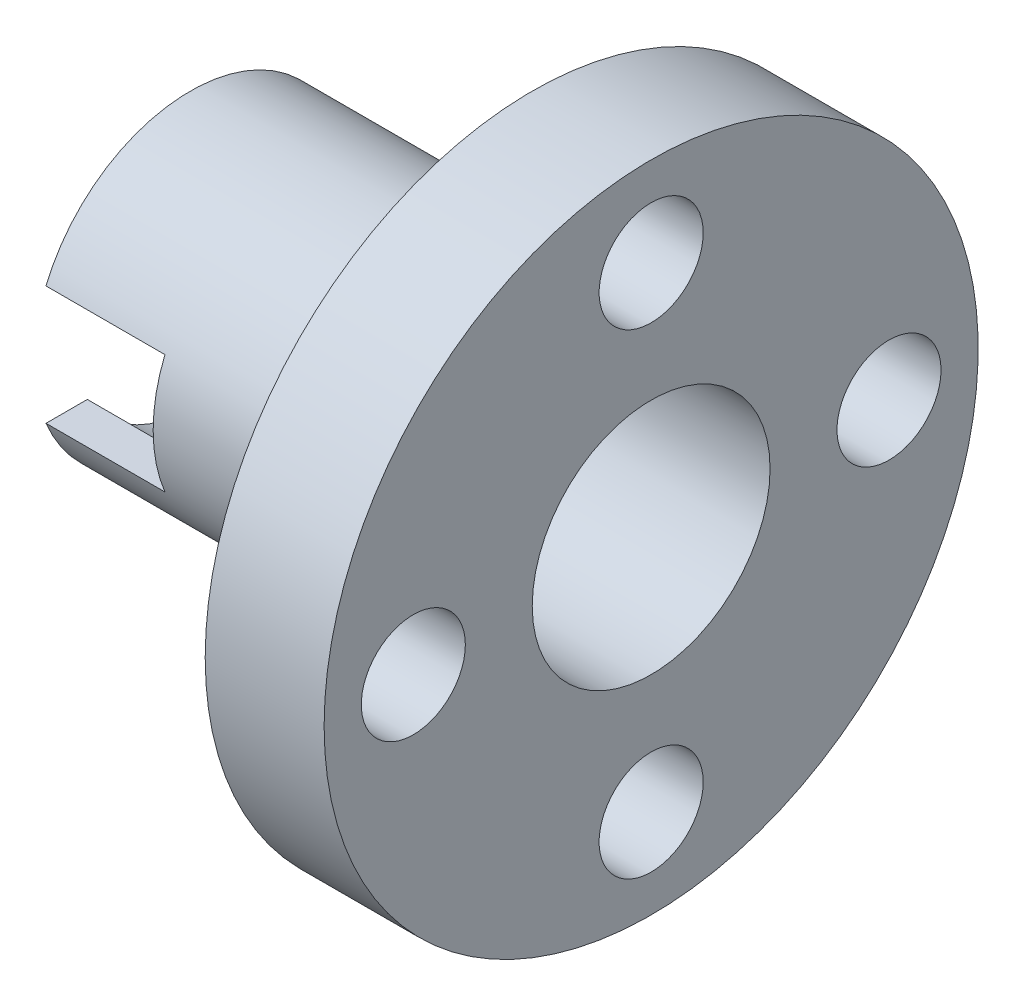
ISO-10303-21;
HEADER;
FILE_DESCRIPTION(('STEP AP214'),'2;1');
FILE_NAME('part.step','',(''),(''),'','','');
FILE_SCHEMA(('AUTOMOTIVE_DESIGN { 1 0 10303 214 1 1 1 1 }'));
ENDSEC;
DATA;
#1=APPLICATION_CONTEXT('core data for automotive mechanical design processes');
#2=APPLICATION_PROTOCOL_DEFINITION('international standard','automotive_design',2000,#1);
#3=PRODUCT_CONTEXT('',#1,'mechanical');
#4=PRODUCT('Part','Part','',(#3));
#5=PRODUCT_RELATED_PRODUCT_CATEGORY('part','',(#4));
#6=PRODUCT_DEFINITION_FORMATION('','',#4);
#7=PRODUCT_DEFINITION_CONTEXT('part definition',#1,'design');
#8=PRODUCT_DEFINITION('design','',#6,#7);
#9=PRODUCT_DEFINITION_SHAPE('','',#8);
#10=(LENGTH_UNIT() NAMED_UNIT(*) SI_UNIT(.MILLI.,.METRE.));
#11=(NAMED_UNIT(*) PLANE_ANGLE_UNIT() SI_UNIT($,.RADIAN.));
#12=(NAMED_UNIT(*) SI_UNIT($,.STERADIAN.) SOLID_ANGLE_UNIT());
#13=UNCERTAINTY_MEASURE_WITH_UNIT(LENGTH_MEASURE(1.E-05),#10,'distance_accuracy_value','');
#14=(GEOMETRIC_REPRESENTATION_CONTEXT(3) GLOBAL_UNCERTAINTY_ASSIGNED_CONTEXT((#13)) GLOBAL_UNIT_ASSIGNED_CONTEXT((#10,
#11,#12)) REPRESENTATION_CONTEXT('',''));
#15=CARTESIAN_POINT('',(0.,0.,0.));
#16=DIRECTION('',(0.,0.,1.));
#17=DIRECTION('',(1.,0.,0.));
#18=AXIS2_PLACEMENT_3D('',#15,#16,#17);
#19=CARTESIAN_POINT('',(-15.5,0.,-4.));
#20=DIRECTION('',(1.,0.,0.));
#21=DIRECTION('',(0.,0.,-1.));
#22=AXIS2_PLACEMENT_3D('',#19,#20,#21);
#23=PLANE('',#22);
#24=CARTESIAN_POINT('',(-15.5,0.,0.));
#25=DIRECTION('',(-1.,0.,0.));
#26=DIRECTION('',(0.,0.,1.));
#27=AXIS2_PLACEMENT_3D('',#24,#25,#26);
#28=CIRCLE('',#27,5.25);
#29=CARTESIAN_POINT('',(-15.5,2.,4.8541219597369));
#30=VERTEX_POINT('',#29);
#31=CARTESIAN_POINT('',(-15.5,2.,-4.8541219597369));
#32=VERTEX_POINT('',#31);
#33=EDGE_CURVE('E178',#30,#32,#28,.T.);
#34=ORIENTED_EDGE('',*,*,#33,.T.);
#35=DIRECTION('',(0.,0.,1.));
#36=VECTOR('',#35,1.);
#37=CARTESIAN_POINT('',(-15.5,2.,-11.));
#38=LINE('',#37,#36);
#39=CARTESIAN_POINT('',(-15.5,2.,-3.46410161513775));
#40=VERTEX_POINT('',#39);
#41=EDGE_CURVE('E124',#32,#40,#38,.T.);
#42=ORIENTED_EDGE('',*,*,#41,.T.);
#43=CARTESIAN_POINT('',(-15.5,0.,0.));
#44=DIRECTION('',(-1.,0.,0.));
#45=DIRECTION('',(0.,0.,1.));
#46=AXIS2_PLACEMENT_3D('',#43,#44,#45);
#47=CIRCLE('',#46,4.);
#48=CARTESIAN_POINT('',(-15.5,2.,3.46410161513775));
#49=VERTEX_POINT('',#48);
#50=EDGE_CURVE('E175',#49,#40,#47,.T.);
#51=ORIENTED_EDGE('',*,*,#50,.F.);
#52=EDGE_CURVE('E128',#49,#30,#38,.T.);
#53=ORIENTED_EDGE('',*,*,#52,.T.);
#54=EDGE_LOOP('',(#34,#42,#51,#53));
#55=FACE_BOUND('',#54,.T.);
#56=ADVANCED_FACE('F34',(#55),#23,.F.);
#57=CARTESIAN_POINT('',(-43.7073170731707,0.,0.));
#58=DIRECTION('',(-1.,0.,0.));
#59=DIRECTION('',(0.,0.,1.));
#60=AXIS2_PLACEMENT_3D('',#57,#58,#59);
#61=CYLINDRICAL_SURFACE('',#60,5.25);
#62=ORIENTED_EDGE('',*,*,#33,.F.);
#63=DIRECTION('',(-1.,0.,0.));
#64=VECTOR('',#63,1.);
#65=CARTESIAN_POINT('',(-43.7073170731707,2.,4.8541219597369));
#66=LINE('',#65,#64);
#67=CARTESIAN_POINT('',(-11.5,2.,4.8541219597369));
#68=VERTEX_POINT('',#67);
#69=EDGE_CURVE('E133',#30,#68,#66,.F.);
#70=ORIENTED_EDGE('',*,*,#69,.T.);
#71=CARTESIAN_POINT('',(-11.5,0.,0.));
#72=DIRECTION('',(1.,0.,0.));
#73=DIRECTION('',(0.,0.,-1.));
#74=AXIS2_PLACEMENT_3D('',#71,#72,#73);
#75=CIRCLE('',#74,5.25);
#76=CARTESIAN_POINT('',(-11.5,-2.,4.8541219597369));
#77=VERTEX_POINT('',#76);
#78=EDGE_CURVE('E110',#68,#77,#75,.T.);
#79=ORIENTED_EDGE('',*,*,#78,.T.);
#80=DIRECTION('',(-1.,0.,0.));
#81=VECTOR('',#80,1.);
#82=CARTESIAN_POINT('',(-43.7073170731707,-2.,4.8541219597369));
#83=LINE('',#82,#81);
#84=CARTESIAN_POINT('',(-15.5,-2.,4.8541219597369));
#85=VERTEX_POINT('',#84);
#86=EDGE_CURVE('E111',#77,#85,#83,.T.);
#87=ORIENTED_EDGE('',*,*,#86,.T.);
#88=CARTESIAN_POINT('',(-15.5,-2.,-4.8541219597369));
#89=VERTEX_POINT('',#88);
#90=EDGE_CURVE('E123',#89,#85,#28,.T.);
#91=ORIENTED_EDGE('',*,*,#90,.F.);
#92=DIRECTION('',(-1.,0.,0.));
#93=VECTOR('',#92,1.);
#94=CARTESIAN_POINT('',(-43.7073170731707,-2.,-4.8541219597369));
#95=LINE('',#94,#93);
#96=CARTESIAN_POINT('',(-11.5,-2.,-4.8541219597369));
#97=VERTEX_POINT('',#96);
#98=EDGE_CURVE('E114',#89,#97,#95,.F.);
#99=ORIENTED_EDGE('',*,*,#98,.T.);
#100=CARTESIAN_POINT('',(-11.5,2.,-4.8541219597369));
#101=VERTEX_POINT('',#100);
#102=EDGE_CURVE('E100',#97,#101,#75,.T.);
#103=ORIENTED_EDGE('',*,*,#102,.T.);
#104=DIRECTION('',(-1.,0.,0.));
#105=VECTOR('',#104,1.);
#106=CARTESIAN_POINT('',(-43.7073170731707,2.,-4.8541219597369));
#107=LINE('',#106,#105);
#108=EDGE_CURVE('E136',#101,#32,#107,.T.);
#109=ORIENTED_EDGE('',*,*,#108,.T.);
#110=EDGE_LOOP('',(#62,#70,#79,#87,#91,#99,#103,#109));
#111=FACE_BOUND('',#110,.T.);
#112=CARTESIAN_POINT('',(-4.,0.,0.));
#113=DIRECTION('',(-1.,0.,0.));
#114=DIRECTION('',(0.,0.,1.));
#115=AXIS2_PLACEMENT_3D('',#112,#113,#114);
#116=CIRCLE('',#115,5.25);
#117=CARTESIAN_POINT('',(-4.,0.,5.25));
#118=VERTEX_POINT('',#117);
#119=EDGE_CURVE('E146',#118,#118,#116,.T.);
#120=ORIENTED_EDGE('',*,*,#119,.T.);
#121=EDGE_LOOP('',(#120));
#122=FACE_BOUND('',#121,.T.);
#123=ADVANCED_FACE('F36',(#111,#122),#61,.T.);
#124=ORIENTED_EDGE('',*,*,#90,.T.);
#125=DIRECTION('',(0.,0.,1.));
#126=VECTOR('',#125,1.);
#127=CARTESIAN_POINT('',(-15.5,-2.,-11.));
#128=LINE('',#127,#126);
#129=CARTESIAN_POINT('',(-15.5,-2.,3.46410161513775));
#130=VERTEX_POINT('',#129);
#131=EDGE_CURVE('E131',#130,#85,#128,.T.);
#132=ORIENTED_EDGE('',*,*,#131,.F.);
#133=CARTESIAN_POINT('',(-15.5,-2.,-3.46410161513775));
#134=VERTEX_POINT('',#133);
#135=EDGE_CURVE('E174',#134,#130,#47,.T.);
#136=ORIENTED_EDGE('',*,*,#135,.F.);
#137=EDGE_CURVE('E57',#89,#134,#128,.T.);
#138=ORIENTED_EDGE('',*,*,#137,.F.);
#139=EDGE_LOOP('',(#124,#132,#136,#138));
#140=FACE_BOUND('',#139,.T.);
#141=ADVANCED_FACE('F204',(#140),#23,.F.);
#142=CARTESIAN_POINT('',(-43.7073170731707,0.,0.));
#143=DIRECTION('',(-1.,0.,0.));
#144=DIRECTION('',(0.,0.,1.));
#145=AXIS2_PLACEMENT_3D('',#142,#143,#144);
#146=CYLINDRICAL_SURFACE('',#145,4.);
#147=CARTESIAN_POINT('',(0.,0.,0.));
#148=DIRECTION('',(-1.,0.,0.));
#149=DIRECTION('',(0.,0.,1.));
#150=AXIS2_PLACEMENT_3D('',#147,#148,#149);
#151=CIRCLE('',#150,4.);
#152=CARTESIAN_POINT('',(0.,0.,4.));
#153=VERTEX_POINT('',#152);
#154=EDGE_CURVE('E171',#153,#153,#151,.T.);
#155=ORIENTED_EDGE('',*,*,#154,.F.);
#156=EDGE_LOOP('',(#155));
#157=FACE_BOUND('',#156,.T.);
#158=CARTESIAN_POINT('',(-11.5,0.,0.));
#159=DIRECTION('',(1.,0.,0.));
#160=DIRECTION('',(0.,0.,-1.));
#161=AXIS2_PLACEMENT_3D('',#158,#159,#160);
#162=CIRCLE('',#161,4.);
#163=CARTESIAN_POINT('',(-11.5,-2.,3.46410161513775));
#164=VERTEX_POINT('',#163);
#165=CARTESIAN_POINT('',(-11.5,2.,3.46410161513775));
#166=VERTEX_POINT('',#165);
#167=EDGE_CURVE('E42',#164,#166,#162,.F.);
#168=ORIENTED_EDGE('',*,*,#167,.T.);
#169=DIRECTION('',(-1.,0.,0.));
#170=VECTOR('',#169,1.);
#171=CARTESIAN_POINT('',(-43.7073170731707,2.,3.46410161513775));
#172=LINE('',#171,#170);
#173=EDGE_CURVE('E11',#166,#49,#172,.T.);
#174=ORIENTED_EDGE('',*,*,#173,.T.);
#175=ORIENTED_EDGE('',*,*,#50,.T.);
#176=DIRECTION('',(-1.,0.,0.));
#177=VECTOR('',#176,1.);
#178=CARTESIAN_POINT('',(-43.7073170731707,2.,-3.46410161513775));
#179=LINE('',#178,#177);
#180=CARTESIAN_POINT('',(-11.5,2.,-3.46410161513775));
#181=VERTEX_POINT('',#180);
#182=EDGE_CURVE('E184',#40,#181,#179,.F.);
#183=ORIENTED_EDGE('',*,*,#182,.T.);
#184=CARTESIAN_POINT('',(-11.5,-2.,-3.46410161513775));
#185=VERTEX_POINT('',#184);
#186=EDGE_CURVE('E182',#181,#185,#162,.F.);
#187=ORIENTED_EDGE('',*,*,#186,.T.);
#188=DIRECTION('',(-1.,0.,0.));
#189=VECTOR('',#188,1.);
#190=CARTESIAN_POINT('',(-43.7073170731707,-2.,-3.46410161513775));
#191=LINE('',#190,#189);
#192=EDGE_CURVE('E115',#185,#134,#191,.T.);
#193=ORIENTED_EDGE('',*,*,#192,.T.);
#194=ORIENTED_EDGE('',*,*,#135,.T.);
#195=DIRECTION('',(-1.,0.,0.));
#196=VECTOR('',#195,1.);
#197=CARTESIAN_POINT('',(-43.7073170731707,-2.,3.46410161513775));
#198=LINE('',#197,#196);
#199=EDGE_CURVE('E186',#130,#164,#198,.F.);
#200=ORIENTED_EDGE('',*,*,#199,.T.);
#201=EDGE_LOOP('',(#168,#174,#175,#183,#187,#193,#194,#200));
#202=FACE_BOUND('',#201,.T.);
#203=ADVANCED_FACE('F191',(#157,#202),#146,.F.);
#204=CARTESIAN_POINT('',(0.,0.,-11.));
#205=DIRECTION('',(-1.,0.,0.));
#206=DIRECTION('',(0.,0.,1.));
#207=AXIS2_PLACEMENT_3D('',#204,#205,#206);
#208=PLANE('',#207);
#209=CARTESIAN_POINT('',(0.,8.,0.));
#210=DIRECTION('',(1.,0.,0.));
#211=DIRECTION('',(0.,0.,-1.));
#212=AXIS2_PLACEMENT_3D('',#209,#210,#211);
#213=CIRCLE('',#212,1.75);
#214=CARTESIAN_POINT('',(0.,8.,-1.75));
#215=VERTEX_POINT('',#214);
#216=EDGE_CURVE('E139',#215,#215,#213,.T.);
#217=ORIENTED_EDGE('',*,*,#216,.F.);
#218=EDGE_LOOP('',(#217));
#219=FACE_BOUND('',#218,.T.);
#220=CARTESIAN_POINT('',(0.,0.,-8.));
#221=DIRECTION('',(1.,0.,0.));
#222=DIRECTION('',(0.,0.,-1.));
#223=AXIS2_PLACEMENT_3D('',#220,#221,#222);
#224=CIRCLE('',#223,1.75);
#225=CARTESIAN_POINT('',(0.,0.,-9.75));
#226=VERTEX_POINT('',#225);
#227=EDGE_CURVE('E147',#226,#226,#224,.T.);
#228=ORIENTED_EDGE('',*,*,#227,.F.);
#229=EDGE_LOOP('',(#228));
#230=FACE_BOUND('',#229,.T.);
#231=CARTESIAN_POINT('',(0.,-8.,0.));
#232=DIRECTION('',(1.,0.,0.));
#233=DIRECTION('',(0.,0.,-1.));
#234=AXIS2_PLACEMENT_3D('',#231,#232,#233);
#235=CIRCLE('',#234,1.75);
#236=CARTESIAN_POINT('',(0.,-8.,-1.75));
#237=VERTEX_POINT('',#236);
#238=EDGE_CURVE('E153',#237,#237,#235,.T.);
#239=ORIENTED_EDGE('',*,*,#238,.F.);
#240=EDGE_LOOP('',(#239));
#241=FACE_BOUND('',#240,.T.);
#242=CARTESIAN_POINT('',(0.,0.,8.));
#243=DIRECTION('',(1.,0.,0.));
#244=DIRECTION('',(0.,0.,-1.));
#245=AXIS2_PLACEMENT_3D('',#242,#243,#244);
#246=CIRCLE('',#245,1.75);
#247=CARTESIAN_POINT('',(0.,0.,6.25));
#248=VERTEX_POINT('',#247);
#249=EDGE_CURVE('E138',#248,#248,#246,.T.);
#250=ORIENTED_EDGE('',*,*,#249,.F.);
#251=EDGE_LOOP('',(#250));
#252=FACE_BOUND('',#251,.T.);
#253=CARTESIAN_POINT('',(0.,0.,0.));
#254=DIRECTION('',(-1.,0.,0.));
#255=DIRECTION('',(0.,0.,1.));
#256=AXIS2_PLACEMENT_3D('',#253,#254,#255);
#257=CIRCLE('',#256,11.);
#258=CARTESIAN_POINT('',(0.,0.,11.));
#259=VERTEX_POINT('',#258);
#260=EDGE_CURVE('E168',#259,#259,#257,.T.);
#261=ORIENTED_EDGE('',*,*,#260,.F.);
#262=EDGE_LOOP('',(#261));
#263=FACE_BOUND('',#262,.T.);
#264=ORIENTED_EDGE('',*,*,#154,.T.);
#265=EDGE_LOOP('',(#264));
#266=FACE_BOUND('',#265,.T.);
#267=ADVANCED_FACE('F226',(#219,#230,#241,#252,#263,#266),#208,.F.);
#268=CARTESIAN_POINT('',(-43.7073170731707,0.,0.));
#269=DIRECTION('',(-1.,0.,0.));
#270=DIRECTION('',(0.,0.,1.));
#271=AXIS2_PLACEMENT_3D('',#268,#269,#270);
#272=CYLINDRICAL_SURFACE('',#271,11.);
#273=CARTESIAN_POINT('',(-4.,0.,0.));
#274=DIRECTION('',(-1.,0.,0.));
#275=DIRECTION('',(0.,0.,1.));
#276=AXIS2_PLACEMENT_3D('',#273,#274,#275);
#277=CIRCLE('',#276,11.);
#278=CARTESIAN_POINT('',(-4.,0.,11.));
#279=VERTEX_POINT('',#278);
#280=EDGE_CURVE('E165',#279,#279,#277,.T.);
#281=ORIENTED_EDGE('',*,*,#280,.F.);
#282=EDGE_LOOP('',(#281));
#283=FACE_BOUND('',#282,.T.);
#284=ORIENTED_EDGE('',*,*,#260,.T.);
#285=EDGE_LOOP('',(#284));
#286=FACE_BOUND('',#285,.T.);
#287=ADVANCED_FACE('F231',(#283,#286),#272,.T.);
#288=CARTESIAN_POINT('',(-4.,0.,-5.25));
#289=DIRECTION('',(1.,0.,0.));
#290=DIRECTION('',(0.,0.,-1.));
#291=AXIS2_PLACEMENT_3D('',#288,#289,#290);
#292=PLANE('',#291);
#293=CARTESIAN_POINT('',(-4.,8.,0.));
#294=DIRECTION('',(1.,0.,0.));
#295=DIRECTION('',(0.,0.,-1.));
#296=AXIS2_PLACEMENT_3D('',#293,#294,#295);
#297=CIRCLE('',#296,1.75);
#298=CARTESIAN_POINT('',(-4.,8.,-1.75));
#299=VERTEX_POINT('',#298);
#300=EDGE_CURVE('E142',#299,#299,#297,.F.);
#301=ORIENTED_EDGE('',*,*,#300,.F.);
#302=EDGE_LOOP('',(#301));
#303=FACE_BOUND('',#302,.T.);
#304=CARTESIAN_POINT('',(-4.,0.,-8.));
#305=DIRECTION('',(1.,0.,0.));
#306=DIRECTION('',(0.,0.,-1.));
#307=AXIS2_PLACEMENT_3D('',#304,#305,#306);
#308=CIRCLE('',#307,1.75);
#309=CARTESIAN_POINT('',(-4.,0.,-9.75));
#310=VERTEX_POINT('',#309);
#311=EDGE_CURVE('E143',#310,#310,#308,.F.);
#312=ORIENTED_EDGE('',*,*,#311,.F.);
#313=EDGE_LOOP('',(#312));
#314=FACE_BOUND('',#313,.T.);
#315=CARTESIAN_POINT('',(-4.,-8.,0.));
#316=DIRECTION('',(1.,0.,0.));
#317=DIRECTION('',(0.,0.,-1.));
#318=AXIS2_PLACEMENT_3D('',#315,#316,#317);
#319=CIRCLE('',#318,1.75);
#320=CARTESIAN_POINT('',(-4.,-8.,-1.75));
#321=VERTEX_POINT('',#320);
#322=EDGE_CURVE('E150',#321,#321,#319,.F.);
#323=ORIENTED_EDGE('',*,*,#322,.F.);
#324=EDGE_LOOP('',(#323));
#325=FACE_BOUND('',#324,.T.);
#326=CARTESIAN_POINT('',(-4.,0.,8.));
#327=DIRECTION('',(1.,0.,0.));
#328=DIRECTION('',(0.,0.,-1.));
#329=AXIS2_PLACEMENT_3D('',#326,#327,#328);
#330=CIRCLE('',#329,1.75);
#331=CARTESIAN_POINT('',(-4.,0.,6.25));
#332=VERTEX_POINT('',#331);
#333=EDGE_CURVE('E156',#332,#332,#330,.F.);
#334=ORIENTED_EDGE('',*,*,#333,.F.);
#335=EDGE_LOOP('',(#334));
#336=FACE_BOUND('',#335,.T.);
#337=ORIENTED_EDGE('',*,*,#119,.F.);
#338=EDGE_LOOP('',(#337));
#339=FACE_BOUND('',#338,.T.);
#340=ORIENTED_EDGE('',*,*,#280,.T.);
#341=EDGE_LOOP('',(#340));
#342=FACE_BOUND('',#341,.T.);
#343=ADVANCED_FACE('F238',(#303,#314,#325,#336,#339,#342),#292,.F.);
#344=CARTESIAN_POINT('',(-15.501,0.,8.));
#345=DIRECTION('',(1.,0.,0.));
#346=DIRECTION('',(0.,0.,-1.));
#347=AXIS2_PLACEMENT_3D('',#344,#345,#346);
#348=CYLINDRICAL_SURFACE('',#347,1.75);
#349=ORIENTED_EDGE('',*,*,#249,.T.);
#350=EDGE_LOOP('',(#349));
#351=FACE_BOUND('',#350,.T.);
#352=ORIENTED_EDGE('',*,*,#333,.T.);
#353=EDGE_LOOP('',(#352));
#354=FACE_BOUND('',#353,.T.);
#355=ADVANCED_FACE('F242',(#351,#354),#348,.F.);
#356=CARTESIAN_POINT('',(-15.501,-8.,0.));
#357=DIRECTION('',(1.,0.,0.));
#358=DIRECTION('',(0.,0.,-1.));
#359=AXIS2_PLACEMENT_3D('',#356,#357,#358);
#360=CYLINDRICAL_SURFACE('',#359,1.75);
#361=ORIENTED_EDGE('',*,*,#238,.T.);
#362=EDGE_LOOP('',(#361));
#363=FACE_BOUND('',#362,.T.);
#364=ORIENTED_EDGE('',*,*,#322,.T.);
#365=EDGE_LOOP('',(#364));
#366=FACE_BOUND('',#365,.T.);
#367=ADVANCED_FACE('F246',(#363,#366),#360,.F.);
#368=CARTESIAN_POINT('',(-15.501,0.,-8.));
#369=DIRECTION('',(1.,0.,0.));
#370=DIRECTION('',(0.,0.,-1.));
#371=AXIS2_PLACEMENT_3D('',#368,#369,#370);
#372=CYLINDRICAL_SURFACE('',#371,1.75);
#373=ORIENTED_EDGE('',*,*,#227,.T.);
#374=EDGE_LOOP('',(#373));
#375=FACE_BOUND('',#374,.T.);
#376=ORIENTED_EDGE('',*,*,#311,.T.);
#377=EDGE_LOOP('',(#376));
#378=FACE_BOUND('',#377,.T.);
#379=ADVANCED_FACE('F250',(#375,#378),#372,.F.);
#380=CARTESIAN_POINT('',(-15.501,8.,0.));
#381=DIRECTION('',(1.,0.,0.));
#382=DIRECTION('',(0.,0.,-1.));
#383=AXIS2_PLACEMENT_3D('',#380,#381,#382);
#384=CYLINDRICAL_SURFACE('',#383,1.75);
#385=ORIENTED_EDGE('',*,*,#216,.T.);
#386=EDGE_LOOP('',(#385));
#387=FACE_BOUND('',#386,.T.);
#388=ORIENTED_EDGE('',*,*,#300,.T.);
#389=EDGE_LOOP('',(#388));
#390=FACE_BOUND('',#389,.T.);
#391=ADVANCED_FACE('F254',(#387,#390),#384,.F.);
#392=CARTESIAN_POINT('',(-15.5,-2.,-11.));
#393=DIRECTION('',(0.,-1.,0.));
#394=DIRECTION('',(0.,0.,-1.));
#395=AXIS2_PLACEMENT_3D('',#392,#393,#394);
#396=PLANE('',#395);
#397=ORIENTED_EDGE('',*,*,#137,.T.);
#398=ORIENTED_EDGE('',*,*,#192,.F.);
#399=DIRECTION('',(0.,0.,1.));
#400=VECTOR('',#399,1.);
#401=CARTESIAN_POINT('',(-11.5,-2.,-11.));
#402=LINE('',#401,#400);
#403=EDGE_CURVE('E103',#97,#185,#402,.T.);
#404=ORIENTED_EDGE('',*,*,#403,.F.);
#405=ORIENTED_EDGE('',*,*,#98,.F.);
#406=EDGE_LOOP('',(#397,#398,#404,#405));
#407=FACE_BOUND('',#406,.T.);
#408=ADVANCED_FACE('F113',(#407),#396,.F.);
#409=CARTESIAN_POINT('',(-11.5,2.,-11.));
#410=DIRECTION('',(1.,0.,0.));
#411=DIRECTION('',(0.,0.,-1.));
#412=AXIS2_PLACEMENT_3D('',#409,#410,#411);
#413=PLANE('',#412);
#414=ORIENTED_EDGE('',*,*,#403,.T.);
#415=ORIENTED_EDGE('',*,*,#186,.F.);
#416=DIRECTION('',(0.,0.,1.));
#417=VECTOR('',#416,1.);
#418=CARTESIAN_POINT('',(-11.5,2.,-11.));
#419=LINE('',#418,#417);
#420=EDGE_CURVE('E106',#101,#181,#419,.T.);
#421=ORIENTED_EDGE('',*,*,#420,.F.);
#422=ORIENTED_EDGE('',*,*,#102,.F.);
#423=EDGE_LOOP('',(#414,#415,#421,#422));
#424=FACE_BOUND('',#423,.T.);
#425=ADVANCED_FACE('F102',(#424),#413,.F.);
#426=CARTESIAN_POINT('',(-15.5,2.,-11.));
#427=DIRECTION('',(0.,1.,0.));
#428=DIRECTION('',(0.,0.,1.));
#429=AXIS2_PLACEMENT_3D('',#426,#427,#428);
#430=PLANE('',#429);
#431=ORIENTED_EDGE('',*,*,#420,.T.);
#432=ORIENTED_EDGE('',*,*,#182,.F.);
#433=ORIENTED_EDGE('',*,*,#41,.F.);
#434=ORIENTED_EDGE('',*,*,#108,.F.);
#435=EDGE_LOOP('',(#431,#432,#433,#434));
#436=FACE_BOUND('',#435,.T.);
#437=ADVANCED_FACE('F206',(#436),#430,.F.);
#438=ORIENTED_EDGE('',*,*,#52,.F.);
#439=ORIENTED_EDGE('',*,*,#173,.F.);
#440=EDGE_CURVE('E116',#166,#68,#419,.T.);
#441=ORIENTED_EDGE('',*,*,#440,.T.);
#442=ORIENTED_EDGE('',*,*,#69,.F.);
#443=EDGE_LOOP('',(#438,#439,#441,#442));
#444=FACE_BOUND('',#443,.T.);
#445=ADVANCED_FACE('F209',(#444),#430,.F.);
#446=ORIENTED_EDGE('',*,*,#440,.F.);
#447=ORIENTED_EDGE('',*,*,#167,.F.);
#448=EDGE_CURVE('E49',#164,#77,#402,.T.);
#449=ORIENTED_EDGE('',*,*,#448,.T.);
#450=ORIENTED_EDGE('',*,*,#78,.F.);
#451=EDGE_LOOP('',(#446,#447,#449,#450));
#452=FACE_BOUND('',#451,.T.);
#453=ADVANCED_FACE('F195',(#452),#413,.F.);
#454=ORIENTED_EDGE('',*,*,#448,.F.);
#455=ORIENTED_EDGE('',*,*,#199,.F.);
#456=ORIENTED_EDGE('',*,*,#131,.T.);
#457=ORIENTED_EDGE('',*,*,#86,.F.);
#458=EDGE_LOOP('',(#454,#455,#456,#457));
#459=FACE_BOUND('',#458,.T.);
#460=ADVANCED_FACE('F201',(#459),#396,.F.);
#461=CLOSED_SHELL('',(#56,#123,#141,#203,#267,#287,#343,#355,#367,#379,#391,#408,#425,#437,#445,
#453,#460));
#462=MANIFOLD_SOLID_BREP('B2',#461);
#463=ADVANCED_BREP_SHAPE_REPRESENTATION('',(#18,#462),#14);
#464=SHAPE_DEFINITION_REPRESENTATION(#9,#463);
ENDSEC;
END-ISO-10303-21;
